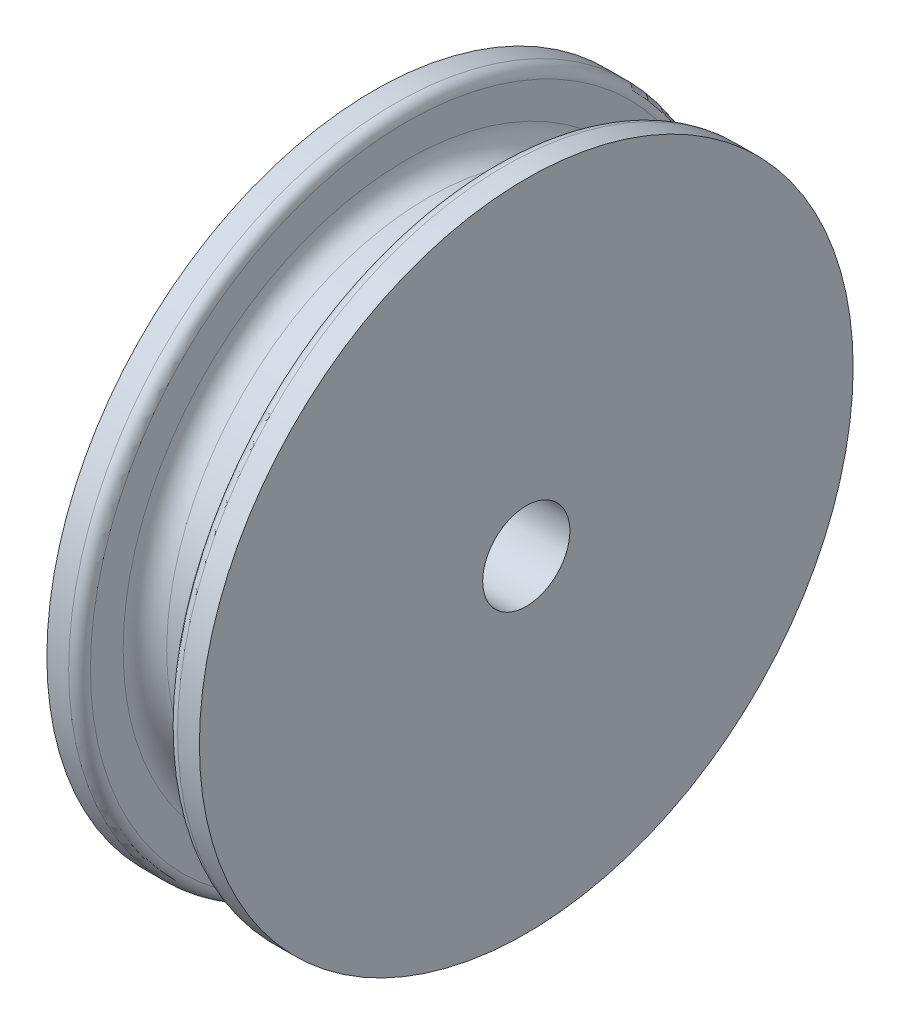
ISO-10303-21;
HEADER;
FILE_DESCRIPTION(('STEP AP214'),'2;1');
FILE_NAME('part.step','',(''),(''),'','','');
FILE_SCHEMA(('AUTOMOTIVE_DESIGN { 1 0 10303 214 1 1 1 1 }'));
ENDSEC;
DATA;
#1=APPLICATION_CONTEXT('core data for automotive mechanical design processes');
#2=APPLICATION_PROTOCOL_DEFINITION('international standard','automotive_design',2000,#1);
#3=PRODUCT_CONTEXT('',#1,'mechanical');
#4=PRODUCT('Part','Part','',(#3));
#5=PRODUCT_RELATED_PRODUCT_CATEGORY('part','',(#4));
#6=PRODUCT_DEFINITION_FORMATION('','',#4);
#7=PRODUCT_DEFINITION_CONTEXT('part definition',#1,'design');
#8=PRODUCT_DEFINITION('design','',#6,#7);
#9=PRODUCT_DEFINITION_SHAPE('','',#8);
#10=(LENGTH_UNIT() NAMED_UNIT(*) SI_UNIT(.MILLI.,.METRE.));
#11=(NAMED_UNIT(*) PLANE_ANGLE_UNIT() SI_UNIT($,.RADIAN.));
#12=(NAMED_UNIT(*) SI_UNIT($,.STERADIAN.) SOLID_ANGLE_UNIT());
#13=UNCERTAINTY_MEASURE_WITH_UNIT(LENGTH_MEASURE(1.E-05),#10,'distance_accuracy_value','');
#14=(GEOMETRIC_REPRESENTATION_CONTEXT(3) GLOBAL_UNCERTAINTY_ASSIGNED_CONTEXT((#13)) GLOBAL_UNIT_ASSIGNED_CONTEXT((#10,
#11,#12)) REPRESENTATION_CONTEXT('',''));
#15=CARTESIAN_POINT('',(0.,0.,0.));
#16=DIRECTION('',(0.,0.,1.));
#17=DIRECTION('',(1.,0.,0.));
#18=AXIS2_PLACEMENT_3D('',#15,#16,#17);
#19=CARTESIAN_POINT('',(1.75,1.,0.));
#20=DIRECTION('',(-1.,0.,0.));
#21=DIRECTION('',(0.,0.,1.));
#22=AXIS2_PLACEMENT_3D('',#19,#20,#21);
#23=PLANE('',#22);
#24=CARTESIAN_POINT('',(1.75,0.,0.));
#25=DIRECTION('',(-1.,0.,0.));
#26=DIRECTION('',(0.,0.,1.));
#27=AXIS2_PLACEMENT_3D('',#24,#25,#26);
#28=CIRCLE('',#27,7.5);
#29=CARTESIAN_POINT('',(1.75,0.,7.5));
#30=VERTEX_POINT('',#29);
#31=EDGE_CURVE('E85',#30,#30,#28,.T.);
#32=ORIENTED_EDGE('',*,*,#31,.F.);
#33=EDGE_LOOP('',(#32));
#34=FACE_BOUND('',#33,.T.);
#35=CARTESIAN_POINT('',(1.75,0.,0.));
#36=DIRECTION('',(-1.,0.,0.));
#37=DIRECTION('',(0.,0.,1.));
#38=AXIS2_PLACEMENT_3D('',#35,#36,#37);
#39=CIRCLE('',#38,1.);
#40=CARTESIAN_POINT('',(1.75,0.,1.));
#41=VERTEX_POINT('',#40);
#42=EDGE_CURVE('E64',#41,#41,#39,.T.);
#43=ORIENTED_EDGE('',*,*,#42,.T.);
#44=EDGE_LOOP('',(#43));
#45=FACE_BOUND('',#44,.T.);
#46=ADVANCED_FACE('F44',(#34,#45),#23,.F.);
#47=CARTESIAN_POINT('',(0.,0.,0.));
#48=DIRECTION('',(-1.,0.,0.));
#49=DIRECTION('',(0.,0.,1.));
#50=AXIS2_PLACEMENT_3D('',#47,#48,#49);
#51=CYLINDRICAL_SURFACE('',#50,1.);
#52=ORIENTED_EDGE('',*,*,#42,.F.);
#53=EDGE_LOOP('',(#52));
#54=FACE_BOUND('',#53,.T.);
#55=CARTESIAN_POINT('',(-1.75,0.,0.));
#56=DIRECTION('',(-1.,0.,0.));
#57=DIRECTION('',(0.,0.,1.));
#58=AXIS2_PLACEMENT_3D('',#55,#56,#57);
#59=CIRCLE('',#58,1.);
#60=CARTESIAN_POINT('',(-1.75,0.,1.));
#61=VERTEX_POINT('',#60);
#62=EDGE_CURVE('E67',#61,#61,#59,.T.);
#63=ORIENTED_EDGE('',*,*,#62,.T.);
#64=EDGE_LOOP('',(#63));
#65=FACE_BOUND('',#64,.T.);
#66=ADVANCED_FACE('F93',(#54,#65),#51,.F.);
#67=CARTESIAN_POINT('',(-1.75,1.,0.));
#68=DIRECTION('',(1.,0.,0.));
#69=DIRECTION('',(0.,0.,-1.));
#70=AXIS2_PLACEMENT_3D('',#67,#68,#69);
#71=PLANE('',#70);
#72=ORIENTED_EDGE('',*,*,#62,.F.);
#73=EDGE_LOOP('',(#72));
#74=FACE_BOUND('',#73,.T.);
#75=CARTESIAN_POINT('',(-1.75,0.,0.));
#76=DIRECTION('',(-1.,0.,0.));
#77=DIRECTION('',(0.,0.,1.));
#78=AXIS2_PLACEMENT_3D('',#75,#76,#77);
#79=CIRCLE('',#78,7.5);
#80=CARTESIAN_POINT('',(-1.75,0.,7.5));
#81=VERTEX_POINT('',#80);
#82=EDGE_CURVE('E70',#81,#81,#79,.T.);
#83=ORIENTED_EDGE('',*,*,#82,.T.);
#84=EDGE_LOOP('',(#83));
#85=FACE_BOUND('',#84,.T.);
#86=ADVANCED_FACE('F99',(#74,#85),#71,.F.);
#87=CARTESIAN_POINT('',(0.,0.,0.));
#88=DIRECTION('',(-1.,0.,0.));
#89=DIRECTION('',(0.,0.,1.));
#90=AXIS2_PLACEMENT_3D('',#87,#88,#89);
#91=CYLINDRICAL_SURFACE('',#90,7.5);
#92=CARTESIAN_POINT('',(-1.25,0.,0.));
#93=DIRECTION('',(-1.,0.,0.));
#94=DIRECTION('',(0.,0.,1.));
#95=AXIS2_PLACEMENT_3D('',#92,#93,#94);
#96=CIRCLE('',#95,7.5);
#97=CARTESIAN_POINT('',(-1.25,0.,7.5));
#98=VERTEX_POINT('',#97);
#99=EDGE_CURVE('E59',#98,#98,#96,.T.);
#100=ORIENTED_EDGE('',*,*,#99,.T.);
#101=EDGE_LOOP('',(#100));
#102=FACE_BOUND('',#101,.T.);
#103=ORIENTED_EDGE('',*,*,#82,.F.);
#104=EDGE_LOOP('',(#103));
#105=FACE_BOUND('',#104,.T.);
#106=ADVANCED_FACE('F105',(#102,#105),#91,.T.);
#107=CARTESIAN_POINT('',(-0.999999999999999,7.5,0.));
#108=DIRECTION('',(-1.,0.,0.));
#109=DIRECTION('',(0.,0.,1.));
#110=AXIS2_PLACEMENT_3D('',#107,#108,#109);
#111=PLANE('',#110);
#112=CARTESIAN_POINT('',(-0.999999999999999,0.,0.));
#113=DIRECTION('',(-1.,0.,0.));
#114=DIRECTION('',(0.,0.,1.));
#115=AXIS2_PLACEMENT_3D('',#112,#113,#114);
#116=CIRCLE('',#115,7.25);
#117=CARTESIAN_POINT('',(-0.999999999999999,0.,7.25));
#118=VERTEX_POINT('',#117);
#119=EDGE_CURVE('E55',#118,#118,#116,.F.);
#120=ORIENTED_EDGE('',*,*,#119,.T.);
#121=EDGE_LOOP('',(#120));
#122=FACE_BOUND('',#121,.T.);
#123=CARTESIAN_POINT('',(-0.999999999999999,0.,0.));
#124=DIRECTION('',(-1.,0.,0.));
#125=DIRECTION('',(0.,0.,1.));
#126=AXIS2_PLACEMENT_3D('',#123,#124,#125);
#127=CIRCLE('',#126,6.5);
#128=CARTESIAN_POINT('',(-0.999999999999999,0.,6.5));
#129=VERTEX_POINT('',#128);
#130=EDGE_CURVE('E73',#129,#129,#127,.T.);
#131=ORIENTED_EDGE('',*,*,#130,.T.);
#132=EDGE_LOOP('',(#131));
#133=FACE_BOUND('',#132,.T.);
#134=ADVANCED_FACE('F110',(#122,#133),#111,.F.);
#135=CARTESIAN_POINT('',(-0.499999999999999,0.,0.));
#136=DIRECTION('',(-1.,0.,0.));
#137=DIRECTION('',(0.,0.,1.));
#138=AXIS2_PLACEMENT_3D('',#135,#136,#137);
#139=TOROIDAL_SURFACE('',#138,6.5,0.5);
#140=ORIENTED_EDGE('',*,*,#130,.F.);
#141=EDGE_LOOP('',(#140));
#142=FACE_BOUND('',#141,.T.);
#143=CARTESIAN_POINT('',(-0.5,0.,0.));
#144=DIRECTION('',(-1.,0.,0.));
#145=DIRECTION('',(0.,0.,1.));
#146=AXIS2_PLACEMENT_3D('',#143,#144,#145);
#147=CIRCLE('',#146,6.);
#148=CARTESIAN_POINT('',(-0.5,0.,6.));
#149=VERTEX_POINT('',#148);
#150=EDGE_CURVE('E76',#149,#149,#147,.T.);
#151=ORIENTED_EDGE('',*,*,#150,.T.);
#152=EDGE_LOOP('',(#151));
#153=FACE_BOUND('',#152,.T.);
#154=ADVANCED_FACE('F116',(#142,#153),#139,.F.);
#155=CARTESIAN_POINT('',(0.,0.,0.));
#156=DIRECTION('',(-1.,0.,0.));
#157=DIRECTION('',(0.,0.,1.));
#158=AXIS2_PLACEMENT_3D('',#155,#156,#157);
#159=CYLINDRICAL_SURFACE('',#158,6.);
#160=ORIENTED_EDGE('',*,*,#150,.F.);
#161=EDGE_LOOP('',(#160));
#162=FACE_BOUND('',#161,.T.);
#163=CARTESIAN_POINT('',(0.499999999999999,0.,0.));
#164=DIRECTION('',(-1.,0.,0.));
#165=DIRECTION('',(0.,0.,1.));
#166=AXIS2_PLACEMENT_3D('',#163,#164,#165);
#167=CIRCLE('',#166,6.);
#168=CARTESIAN_POINT('',(0.499999999999999,0.,6.));
#169=VERTEX_POINT('',#168);
#170=EDGE_CURVE('E79',#169,#169,#167,.T.);
#171=ORIENTED_EDGE('',*,*,#170,.T.);
#172=EDGE_LOOP('',(#171));
#173=FACE_BOUND('',#172,.T.);
#174=ADVANCED_FACE('F138',(#162,#173),#159,.T.);
#175=CARTESIAN_POINT('',(0.499999999999999,0.,0.));
#176=DIRECTION('',(-1.,0.,0.));
#177=DIRECTION('',(0.,0.,1.));
#178=AXIS2_PLACEMENT_3D('',#175,#176,#177);
#179=TOROIDAL_SURFACE('',#178,6.5,0.5);
#180=ORIENTED_EDGE('',*,*,#170,.F.);
#181=EDGE_LOOP('',(#180));
#182=FACE_BOUND('',#181,.T.);
#183=CARTESIAN_POINT('',(1.,0.,0.));
#184=DIRECTION('',(-1.,0.,0.));
#185=DIRECTION('',(0.,0.,1.));
#186=AXIS2_PLACEMENT_3D('',#183,#184,#185);
#187=CIRCLE('',#186,6.5);
#188=CARTESIAN_POINT('',(1.,0.,6.5));
#189=VERTEX_POINT('',#188);
#190=EDGE_CURVE('E82',#189,#189,#187,.T.);
#191=ORIENTED_EDGE('',*,*,#190,.T.);
#192=EDGE_LOOP('',(#191));
#193=FACE_BOUND('',#192,.T.);
#194=ADVANCED_FACE('F143',(#182,#193),#179,.F.);
#195=CARTESIAN_POINT('',(0.999999999999999,7.5,0.));
#196=DIRECTION('',(1.,0.,0.));
#197=DIRECTION('',(0.,0.,-1.));
#198=AXIS2_PLACEMENT_3D('',#195,#196,#197);
#199=PLANE('',#198);
#200=CARTESIAN_POINT('',(0.999999999999999,0.,0.));
#201=DIRECTION('',(1.,0.,0.));
#202=DIRECTION('',(0.,0.,-1.));
#203=AXIS2_PLACEMENT_3D('',#200,#201,#202);
#204=CIRCLE('',#203,7.25);
#205=CARTESIAN_POINT('',(0.999999999999999,0.,-7.25));
#206=VERTEX_POINT('',#205);
#207=EDGE_CURVE('E51',#206,#206,#204,.F.);
#208=ORIENTED_EDGE('',*,*,#207,.T.);
#209=EDGE_LOOP('',(#208));
#210=FACE_BOUND('',#209,.T.);
#211=ORIENTED_EDGE('',*,*,#190,.F.);
#212=EDGE_LOOP('',(#211));
#213=FACE_BOUND('',#212,.T.);
#214=ADVANCED_FACE('F128',(#210,#213),#199,.F.);
#215=CARTESIAN_POINT('',(0.,0.,0.));
#216=DIRECTION('',(-1.,0.,0.));
#217=DIRECTION('',(0.,0.,1.));
#218=AXIS2_PLACEMENT_3D('',#215,#216,#217);
#219=CYLINDRICAL_SURFACE('',#218,7.5);
#220=CARTESIAN_POINT('',(1.25,0.,0.));
#221=DIRECTION('',(1.,0.,0.));
#222=DIRECTION('',(0.,0.,-1.));
#223=AXIS2_PLACEMENT_3D('',#220,#221,#222);
#224=CIRCLE('',#223,7.5);
#225=CARTESIAN_POINT('',(1.25,0.,-7.5));
#226=VERTEX_POINT('',#225);
#227=EDGE_CURVE('E12',#226,#226,#224,.T.);
#228=ORIENTED_EDGE('',*,*,#227,.T.);
#229=EDGE_LOOP('',(#228));
#230=FACE_BOUND('',#229,.T.);
#231=ORIENTED_EDGE('',*,*,#31,.T.);
#232=EDGE_LOOP('',(#231));
#233=FACE_BOUND('',#232,.T.);
#234=ADVANCED_FACE('F89',(#230,#233),#219,.T.);
#235=CARTESIAN_POINT('',(-1.25,0.,0.));
#236=DIRECTION('',(-1.,0.,0.));
#237=DIRECTION('',(0.,0.,1.));
#238=AXIS2_PLACEMENT_3D('',#235,#236,#237);
#239=TOROIDAL_SURFACE('',#238,7.25,0.25);
#240=ORIENTED_EDGE('',*,*,#119,.F.);
#241=EDGE_LOOP('',(#240));
#242=FACE_BOUND('',#241,.T.);
#243=ORIENTED_EDGE('',*,*,#99,.F.);
#244=EDGE_LOOP('',(#243));
#245=FACE_BOUND('',#244,.T.);
#246=ADVANCED_FACE('F120',(#242,#245),#239,.T.);
#247=CARTESIAN_POINT('',(1.25,0.,0.));
#248=DIRECTION('',(1.,0.,0.));
#249=DIRECTION('',(0.,0.,-1.));
#250=AXIS2_PLACEMENT_3D('',#247,#248,#249);
#251=TOROIDAL_SURFACE('',#250,7.25,0.25);
#252=ORIENTED_EDGE('',*,*,#227,.F.);
#253=EDGE_LOOP('',(#252));
#254=FACE_BOUND('',#253,.T.);
#255=ORIENTED_EDGE('',*,*,#207,.F.);
#256=EDGE_LOOP('',(#255));
#257=FACE_BOUND('',#256,.T.);
#258=ADVANCED_FACE('F46',(#254,#257),#251,.T.);
#259=CLOSED_SHELL('',(#46,#66,#86,#106,#134,#154,#174,#194,#214,#234,#246,#258));
#260=MANIFOLD_SOLID_BREP('B2',#259);
#261=ADVANCED_BREP_SHAPE_REPRESENTATION('',(#18,#260),#14);
#262=SHAPE_DEFINITION_REPRESENTATION(#9,#261);
ENDSEC;
END-ISO-10303-21;
